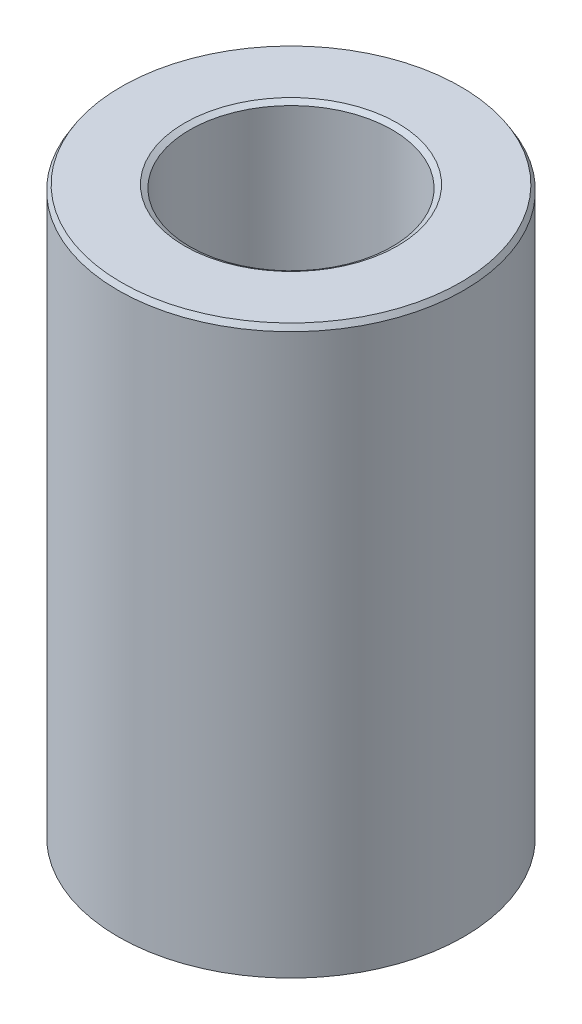
ISO-10303-21;
HEADER;
FILE_DESCRIPTION(('STEP AP214'),'2;1');
FILE_NAME('part.step','',(''),(''),'','','');
FILE_SCHEMA(('AUTOMOTIVE_DESIGN { 1 0 10303 214 1 1 1 1 }'));
ENDSEC;
DATA;
#1=APPLICATION_CONTEXT('core data for automotive mechanical design processes');
#2=APPLICATION_PROTOCOL_DEFINITION('international standard','automotive_design',2000,#1);
#3=PRODUCT_CONTEXT('',#1,'mechanical');
#4=PRODUCT('Part','Part','',(#3));
#5=PRODUCT_RELATED_PRODUCT_CATEGORY('part','',(#4));
#6=PRODUCT_DEFINITION_FORMATION('','',#4);
#7=PRODUCT_DEFINITION_CONTEXT('part definition',#1,'design');
#8=PRODUCT_DEFINITION('design','',#6,#7);
#9=PRODUCT_DEFINITION_SHAPE('','',#8);
#10=(LENGTH_UNIT() NAMED_UNIT(*) SI_UNIT(.MILLI.,.METRE.));
#11=(NAMED_UNIT(*) PLANE_ANGLE_UNIT() SI_UNIT($,.RADIAN.));
#12=(NAMED_UNIT(*) SI_UNIT($,.STERADIAN.) SOLID_ANGLE_UNIT());
#13=UNCERTAINTY_MEASURE_WITH_UNIT(LENGTH_MEASURE(1.E-05),#10,'distance_accuracy_value','');
#14=(GEOMETRIC_REPRESENTATION_CONTEXT(3) GLOBAL_UNCERTAINTY_ASSIGNED_CONTEXT((#13)) GLOBAL_UNIT_ASSIGNED_CONTEXT((#10,
#11,#12)) REPRESENTATION_CONTEXT('',''));
#15=CARTESIAN_POINT('',(0.,0.,0.));
#16=DIRECTION('',(0.,0.,1.));
#17=DIRECTION('',(1.,0.,0.));
#18=AXIS2_PLACEMENT_3D('',#15,#16,#17);
#19=CARTESIAN_POINT('',(0.,197.27375103741,0.));
#20=DIRECTION('',(0.,-1.,0.));
#21=DIRECTION('',(0.,0.,-1.));
#22=AXIS2_PLACEMENT_3D('',#19,#20,#21);
#23=CYLINDRICAL_SURFACE('',#22,60.);
#24=CARTESIAN_POINT('',(0.,1.11013907060364,0.));
#25=DIRECTION('',(0.,1.,0.));
#26=DIRECTION('',(0.,0.,1.));
#27=AXIS2_PLACEMENT_3D('',#24,#25,#26);
#28=CIRCLE('',#27,60.);
#29=CARTESIAN_POINT('',(0.,1.11013907060364,60.));
#30=VERTEX_POINT('',#29);
#31=EDGE_CURVE('E10',#30,#30,#28,.T.);
#32=ORIENTED_EDGE('',*,*,#31,.T.);
#33=EDGE_LOOP('',(#32));
#34=FACE_BOUND('',#33,.T.);
#35=CARTESIAN_POINT('',(0.,195.442094795592,0.));
#36=DIRECTION('',(0.,1.,0.));
#37=DIRECTION('',(0.,0.,1.));
#38=AXIS2_PLACEMENT_3D('',#35,#36,#37);
#39=CIRCLE('',#38,60.);
#40=CARTESIAN_POINT('',(0.,195.442094795592,60.));
#41=VERTEX_POINT('',#40);
#42=EDGE_CURVE('E50',#41,#41,#39,.F.);
#43=ORIENTED_EDGE('',*,*,#42,.T.);
#44=EDGE_LOOP('',(#43));
#45=FACE_BOUND('',#44,.T.);
#46=ADVANCED_FACE('F39',(#34,#45),#23,.T.);
#47=CARTESIAN_POINT('',(0.,197.27375103741,0.));
#48=DIRECTION('',(0.,1.,0.));
#49=DIRECTION('',(0.,0.,1.));
#50=AXIS2_PLACEMENT_3D('',#47,#48,#49);
#51=PLANE('',#50);
#52=CARTESIAN_POINT('',(0.,197.27375103741,0.));
#53=DIRECTION('',(0.,1.,0.));
#54=DIRECTION('',(0.,0.,1.));
#55=AXIS2_PLACEMENT_3D('',#52,#53,#54);
#56=CIRCLE('',#55,36.9705904395998);
#57=CARTESIAN_POINT('',(0.,197.27375103741,36.9705904395998));
#58=VERTEX_POINT('',#57);
#59=EDGE_CURVE('E58',#58,#58,#56,.F.);
#60=ORIENTED_EDGE('',*,*,#59,.T.);
#61=EDGE_LOOP('',(#60));
#62=FACE_BOUND('',#61,.T.);
#63=CARTESIAN_POINT('',(0.,197.27375103741,0.));
#64=DIRECTION('',(0.,1.,0.));
#65=DIRECTION('',(0.,0.,1.));
#66=AXIS2_PLACEMENT_3D('',#63,#64,#65);
#67=CIRCLE('',#66,58.8898609293963);
#68=CARTESIAN_POINT('',(0.,197.27375103741,58.8898609293963));
#69=VERTEX_POINT('',#68);
#70=EDGE_CURVE('E61',#69,#69,#67,.T.);
#71=ORIENTED_EDGE('',*,*,#70,.T.);
#72=EDGE_LOOP('',(#71));
#73=FACE_BOUND('',#72,.T.);
#74=ADVANCED_FACE('F88',(#62,#73),#51,.T.);
#75=CARTESIAN_POINT('',(0.,0.,0.));
#76=DIRECTION('',(0.,1.,0.));
#77=DIRECTION('',(0.,0.,1.));
#78=AXIS2_PLACEMENT_3D('',#75,#76,#77);
#79=PLANE('',#78);
#80=CARTESIAN_POINT('',(0.,0.,0.));
#81=DIRECTION('',(0.,1.,0.));
#82=DIRECTION('',(0.,0.,1.));
#83=AXIS2_PLACEMENT_3D('',#80,#81,#82);
#84=CIRCLE('',#83,36.2490732683853);
#85=CARTESIAN_POINT('',(0.,0.,36.2490732683853));
#86=VERTEX_POINT('',#85);
#87=EDGE_CURVE('E51',#86,#86,#84,.T.);
#88=ORIENTED_EDGE('',*,*,#87,.T.);
#89=EDGE_LOOP('',(#88));
#90=FACE_BOUND('',#89,.T.);
#91=CARTESIAN_POINT('',(0.,0.,0.));
#92=DIRECTION('',(0.,1.,0.));
#93=DIRECTION('',(0.,0.,1.));
#94=AXIS2_PLACEMENT_3D('',#91,#92,#93);
#95=CIRCLE('',#94,58.1683437581818);
#96=CARTESIAN_POINT('',(0.,0.,58.1683437581818));
#97=VERTEX_POINT('',#96);
#98=EDGE_CURVE('E54',#97,#97,#95,.F.);
#99=ORIENTED_EDGE('',*,*,#98,.T.);
#100=EDGE_LOOP('',(#99));
#101=FACE_BOUND('',#100,.T.);
#102=ADVANCED_FACE('F83',(#90,#101),#79,.F.);
#103=CARTESIAN_POINT('',(0.,197.27375103741,0.));
#104=DIRECTION('',(0.,-1.,0.));
#105=DIRECTION('',(0.,0.,-1.));
#106=AXIS2_PLACEMENT_3D('',#103,#104,#105);
#107=CYLINDRICAL_SURFACE('',#106,35.1389341977816);
#108=CARTESIAN_POINT('',(0.,196.163611966807,0.));
#109=DIRECTION('',(0.,1.,0.));
#110=DIRECTION('',(0.,0.,1.));
#111=AXIS2_PLACEMENT_3D('',#108,#109,#110);
#112=CIRCLE('',#111,35.1389341977816);
#113=CARTESIAN_POINT('',(0.,196.163611966807,35.1389341977816));
#114=VERTEX_POINT('',#113);
#115=EDGE_CURVE('E67',#114,#114,#112,.T.);
#116=ORIENTED_EDGE('',*,*,#115,.T.);
#117=EDGE_LOOP('',(#116));
#118=FACE_BOUND('',#117,.T.);
#119=CARTESIAN_POINT('',(0.,1.83165624181825,0.));
#120=DIRECTION('',(0.,1.,0.));
#121=DIRECTION('',(0.,0.,1.));
#122=AXIS2_PLACEMENT_3D('',#119,#120,#121);
#123=CIRCLE('',#122,35.1389341977816);
#124=CARTESIAN_POINT('',(0.,1.83165624181825,35.1389341977816));
#125=VERTEX_POINT('',#124);
#126=EDGE_CURVE('E69',#125,#125,#123,.F.);
#127=ORIENTED_EDGE('',*,*,#126,.T.);
#128=EDGE_LOOP('',(#127));
#129=FACE_BOUND('',#128,.T.);
#130=ADVANCED_FACE('F71',(#118,#129),#107,.F.);
#131=CARTESIAN_POINT('',(0.,196.163611966807,0.));
#132=DIRECTION('',(0.,1.,0.));
#133=DIRECTION('',(0.,0.,1.));
#134=AXIS2_PLACEMENT_3D('',#131,#132,#133);
#135=CONICAL_SURFACE('',#134,35.1389341977816,1.02591469157366);
#136=ORIENTED_EDGE('',*,*,#59,.F.);
#137=EDGE_LOOP('',(#136));
#138=FACE_BOUND('',#137,.T.);
#139=ORIENTED_EDGE('',*,*,#115,.F.);
#140=EDGE_LOOP('',(#139));
#141=FACE_BOUND('',#140,.T.);
#142=ADVANCED_FACE('F77',(#138,#141),#135,.F.);
#143=CARTESIAN_POINT('',(0.,0.,0.));
#144=DIRECTION('',(0.,-1.,0.));
#145=DIRECTION('',(0.,0.,-1.));
#146=AXIS2_PLACEMENT_3D('',#143,#144,#145);
#147=CONICAL_SURFACE('',#146,36.2490732683853,0.544881635221223);
#148=ORIENTED_EDGE('',*,*,#126,.F.);
#149=EDGE_LOOP('',(#148));
#150=FACE_BOUND('',#149,.T.);
#151=ORIENTED_EDGE('',*,*,#87,.F.);
#152=EDGE_LOOP('',(#151));
#153=FACE_BOUND('',#152,.T.);
#154=ADVANCED_FACE('F73',(#150,#153),#147,.F.);
#155=CARTESIAN_POINT('',(0.,1.11013907060364,0.));
#156=DIRECTION('',(0.,1.,0.));
#157=DIRECTION('',(0.,0.,1.));
#158=AXIS2_PLACEMENT_3D('',#155,#156,#157);
#159=CONICAL_SURFACE('',#158,60.,1.02591469157367);
#160=ORIENTED_EDGE('',*,*,#98,.F.);
#161=EDGE_LOOP('',(#160));
#162=FACE_BOUND('',#161,.T.);
#163=ORIENTED_EDGE('',*,*,#31,.F.);
#164=EDGE_LOOP('',(#163));
#165=FACE_BOUND('',#164,.T.);
#166=ADVANCED_FACE('F76',(#162,#165),#159,.T.);
#167=CARTESIAN_POINT('',(0.,197.27375103741,0.));
#168=DIRECTION('',(0.,-1.,0.));
#169=DIRECTION('',(0.,0.,-1.));
#170=AXIS2_PLACEMENT_3D('',#167,#168,#169);
#171=CONICAL_SURFACE('',#170,58.8898609293963,0.54488163522122);
#172=ORIENTED_EDGE('',*,*,#42,.F.);
#173=EDGE_LOOP('',(#172));
#174=FACE_BOUND('',#173,.T.);
#175=ORIENTED_EDGE('',*,*,#70,.F.);
#176=EDGE_LOOP('',(#175));
#177=FACE_BOUND('',#176,.T.);
#178=ADVANCED_FACE('F45',(#174,#177),#171,.T.);
#179=CLOSED_SHELL('',(#46,#74,#102,#130,#142,#154,#166,#178));
#180=MANIFOLD_SOLID_BREP('B2',#179);
#181=ADVANCED_BREP_SHAPE_REPRESENTATION('',(#18,#180),#14);
#182=SHAPE_DEFINITION_REPRESENTATION(#9,#181);
ENDSEC;
END-ISO-10303-21;
